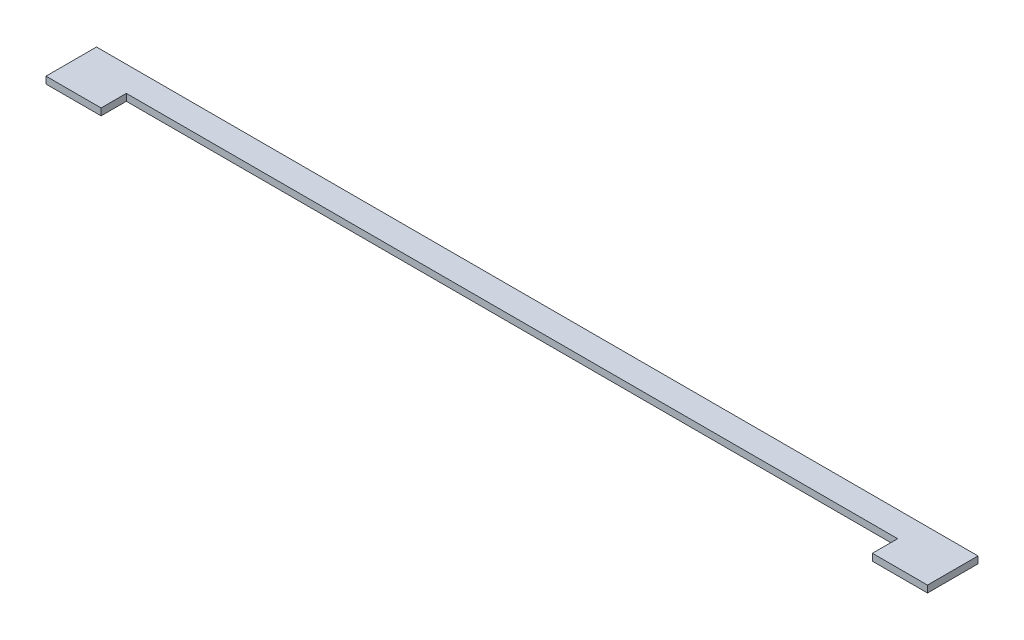
ISO-10303-21;
HEADER;
FILE_DESCRIPTION(('STEP AP214'),'2;1');
FILE_NAME('part.step','',(''),(''),'','','');
FILE_SCHEMA(('AUTOMOTIVE_DESIGN { 1 0 10303 214 1 1 1 1 }'));
ENDSEC;
DATA;
#1=APPLICATION_CONTEXT('core data for automotive mechanical design processes');
#2=APPLICATION_PROTOCOL_DEFINITION('international standard','automotive_design',2000,#1);
#3=PRODUCT_CONTEXT('',#1,'mechanical');
#4=PRODUCT('Part','Part','',(#3));
#5=PRODUCT_RELATED_PRODUCT_CATEGORY('part','',(#4));
#6=PRODUCT_DEFINITION_FORMATION('','',#4);
#7=PRODUCT_DEFINITION_CONTEXT('part definition',#1,'design');
#8=PRODUCT_DEFINITION('design','',#6,#7);
#9=PRODUCT_DEFINITION_SHAPE('','',#8);
#10=(LENGTH_UNIT() NAMED_UNIT(*) SI_UNIT(.MILLI.,.METRE.));
#11=(NAMED_UNIT(*) PLANE_ANGLE_UNIT() SI_UNIT($,.RADIAN.));
#12=(NAMED_UNIT(*) SI_UNIT($,.STERADIAN.) SOLID_ANGLE_UNIT());
#13=UNCERTAINTY_MEASURE_WITH_UNIT(LENGTH_MEASURE(1.E-05),#10,'distance_accuracy_value','');
#14=(GEOMETRIC_REPRESENTATION_CONTEXT(3) GLOBAL_UNCERTAINTY_ASSIGNED_CONTEXT((#13)) GLOBAL_UNIT_ASSIGNED_CONTEXT((#10,
#11,#12)) REPRESENTATION_CONTEXT('',''));
#15=CARTESIAN_POINT('',(0.,0.,0.));
#16=DIRECTION('',(0.,0.,1.));
#17=DIRECTION('',(1.,0.,0.));
#18=AXIS2_PLACEMENT_3D('',#15,#16,#17);
#19=CARTESIAN_POINT('',(-4183.01400519296,38.1,-128.418281868106));
#20=DIRECTION('',(1.,0.,0.));
#21=DIRECTION('',(0.,0.,-1.));
#22=AXIS2_PLACEMENT_3D('',#19,#20,#21);
#23=PLANE('',#22);
#24=DIRECTION('',(0.,0.,1.));
#25=VECTOR('',#24,1.);
#26=CARTESIAN_POINT('',(-4183.01400519296,0.,-128.418281868106));
#27=LINE('',#26,#25);
#28=CARTESIAN_POINT('',(-4183.01400519296,0.,-128.426397217144));
#29=VERTEX_POINT('',#28);
#30=CARTESIAN_POINT('',(-4183.01400519296,0.,11.2736027828564));
#31=VERTEX_POINT('',#30);
#32=EDGE_CURVE('E126',#29,#31,#27,.T.);
#33=ORIENTED_EDGE('',*,*,#32,.F.);
#34=DIRECTION('',(0.,-1.,0.));
#35=VECTOR('',#34,1.);
#36=CARTESIAN_POINT('',(-4183.01400519296,38.1,-128.426397217144));
#37=LINE('',#36,#35);
#38=CARTESIAN_POINT('',(-4183.01400519296,38.1,-128.426397217144));
#39=VERTEX_POINT('',#38);
#40=EDGE_CURVE('E11',#39,#29,#37,.T.);
#41=ORIENTED_EDGE('',*,*,#40,.F.);
#42=DIRECTION('',(0.,0.,1.));
#43=VECTOR('',#42,1.);
#44=CARTESIAN_POINT('',(-4183.01400519296,38.1,-128.418281868106));
#45=LINE('',#44,#43);
#46=CARTESIAN_POINT('',(-4183.01400519296,38.1,11.2736027828564));
#47=VERTEX_POINT('',#46);
#48=EDGE_CURVE('E144',#39,#47,#45,.T.);
#49=ORIENTED_EDGE('',*,*,#48,.T.);
#50=DIRECTION('',(0.,-1.,0.));
#51=VECTOR('',#50,1.);
#52=CARTESIAN_POINT('',(-4183.01400519296,38.1,11.2736027828564));
#53=LINE('',#52,#51);
#54=EDGE_CURVE('E81',#47,#31,#53,.T.);
#55=ORIENTED_EDGE('',*,*,#54,.T.);
#56=EDGE_LOOP('',(#33,#41,#49,#55));
#57=FACE_BOUND('',#56,.T.);
#58=ADVANCED_FACE('F31',(#57),#23,.T.);
#59=CARTESIAN_POINT('',(-5849.1100593099,38.1,-128.426397217144));
#60=DIRECTION('',(0.,0.,-1.));
#61=DIRECTION('',(-1.,0.,0.));
#62=AXIS2_PLACEMENT_3D('',#59,#60,#61);
#63=PLANE('',#62);
#64=DIRECTION('',(1.,0.,0.));
#65=VECTOR('',#64,1.);
#66=CARTESIAN_POINT('',(-5849.1100593099,0.,-128.426397217144));
#67=LINE('',#66,#65);
#68=CARTESIAN_POINT('',(84.1859948070392,0.,-128.426397217144));
#69=VERTEX_POINT('',#68);
#70=EDGE_CURVE('E129',#29,#69,#67,.T.);
#71=ORIENTED_EDGE('',*,*,#70,.T.);
#72=DIRECTION('',(0.,-1.,0.));
#73=VECTOR('',#72,1.);
#74=CARTESIAN_POINT('',(84.1859948070392,38.1,-128.426397217144));
#75=LINE('',#74,#73);
#76=CARTESIAN_POINT('',(84.1859948070392,38.1,-128.426397217144));
#77=VERTEX_POINT('',#76);
#78=EDGE_CURVE('E39',#77,#69,#75,.T.);
#79=ORIENTED_EDGE('',*,*,#78,.F.);
#80=DIRECTION('',(1.,0.,0.));
#81=VECTOR('',#80,1.);
#82=CARTESIAN_POINT('',(-5849.1100593099,38.1,-128.426397217144));
#83=LINE('',#82,#81);
#84=EDGE_CURVE('E168',#39,#77,#83,.T.);
#85=ORIENTED_EDGE('',*,*,#84,.F.);
#86=ORIENTED_EDGE('',*,*,#40,.T.);
#87=EDGE_LOOP('',(#71,#79,#85,#86));
#88=FACE_BOUND('',#87,.T.);
#89=ADVANCED_FACE('F172',(#88),#63,.F.);
#90=CARTESIAN_POINT('',(84.18599480704,38.1,-128.418281868122));
#91=DIRECTION('',(1.,0.,0.));
#92=DIRECTION('',(0.,0.,-1.));
#93=AXIS2_PLACEMENT_3D('',#90,#91,#92);
#94=PLANE('',#93);
#95=DIRECTION('',(0.,0.,1.));
#96=VECTOR('',#95,1.);
#97=CARTESIAN_POINT('',(84.18599480704,0.,-128.418281868122));
#98=LINE('',#97,#96);
#99=CARTESIAN_POINT('',(84.18599480704,0.,11.2736027828565));
#100=VERTEX_POINT('',#99);
#101=EDGE_CURVE('E131',#69,#100,#98,.T.);
#102=ORIENTED_EDGE('',*,*,#101,.T.);
#103=DIRECTION('',(0.,-1.,0.));
#104=VECTOR('',#103,1.);
#105=CARTESIAN_POINT('',(84.18599480704,38.1,11.2736027828565));
#106=LINE('',#105,#104);
#107=CARTESIAN_POINT('',(84.18599480704,38.1,11.2736027828565));
#108=VERTEX_POINT('',#107);
#109=EDGE_CURVE('E150',#108,#100,#106,.T.);
#110=ORIENTED_EDGE('',*,*,#109,.F.);
#111=DIRECTION('',(0.,0.,1.));
#112=VECTOR('',#111,1.);
#113=CARTESIAN_POINT('',(84.18599480704,38.1,-128.418281868122));
#114=LINE('',#113,#112);
#115=EDGE_CURVE('E158',#77,#108,#114,.T.);
#116=ORIENTED_EDGE('',*,*,#115,.F.);
#117=ORIENTED_EDGE('',*,*,#78,.T.);
#118=EDGE_LOOP('',(#102,#110,#116,#117));
#119=FACE_BOUND('',#118,.T.);
#120=ADVANCED_FACE('F156',(#119),#94,.F.);
#121=CARTESIAN_POINT('',(-5849.1100593099,38.1,11.2736027828576));
#122=DIRECTION('',(0.,0.,1.));
#123=DIRECTION('',(1.,0.,0.));
#124=AXIS2_PLACEMENT_3D('',#121,#122,#123);
#125=PLANE('',#124);
#126=DIRECTION('',(-1.,0.,0.));
#127=VECTOR('',#126,1.);
#128=CARTESIAN_POINT('',(-5849.1100593099,0.,11.2736027828576));
#129=LINE('',#128,#127);
#130=CARTESIAN_POINT('',(388.98599480704,0.,11.2736027828564));
#131=VERTEX_POINT('',#130);
#132=EDGE_CURVE('E134',#131,#100,#129,.T.);
#133=ORIENTED_EDGE('',*,*,#132,.F.);
#134=DIRECTION('',(0.,-1.,0.));
#135=VECTOR('',#134,1.);
#136=CARTESIAN_POINT('',(388.98599480704,38.1,11.2736027828564));
#137=LINE('',#136,#135);
#138=CARTESIAN_POINT('',(388.98599480704,38.1,11.2736027828564));
#139=VERTEX_POINT('',#138);
#140=EDGE_CURVE('E148',#139,#131,#137,.T.);
#141=ORIENTED_EDGE('',*,*,#140,.F.);
#142=DIRECTION('',(-1.,0.,0.));
#143=VECTOR('',#142,1.);
#144=CARTESIAN_POINT('',(-5849.1100593099,38.1,11.2736027828576));
#145=LINE('',#144,#143);
#146=EDGE_CURVE('E121',#139,#108,#145,.T.);
#147=ORIENTED_EDGE('',*,*,#146,.T.);
#148=ORIENTED_EDGE('',*,*,#109,.T.);
#149=EDGE_LOOP('',(#133,#141,#147,#148));
#150=FACE_BOUND('',#149,.T.);
#151=ADVANCED_FACE('F166',(#150),#125,.T.);
#152=CARTESIAN_POINT('',(388.98599480704,38.1,-128.418281868106));
#153=DIRECTION('',(1.,0.,0.));
#154=DIRECTION('',(0.,0.,-1.));
#155=AXIS2_PLACEMENT_3D('',#152,#153,#154);
#156=PLANE('',#155);
#157=DIRECTION('',(0.,0.,1.));
#158=VECTOR('',#157,1.);
#159=CARTESIAN_POINT('',(388.98599480704,0.,-128.418281868106));
#160=LINE('',#159,#158);
#161=CARTESIAN_POINT('',(388.98599480704,0.,-268.126397217144));
#162=VERTEX_POINT('',#161);
#163=EDGE_CURVE('E137',#162,#131,#160,.T.);
#164=ORIENTED_EDGE('',*,*,#163,.F.);
#165=DIRECTION('',(0.,-1.,0.));
#166=VECTOR('',#165,1.);
#167=CARTESIAN_POINT('',(388.98599480704,38.1,-268.126397217144));
#168=LINE('',#167,#166);
#169=CARTESIAN_POINT('',(388.98599480704,38.1,-268.126397217144));
#170=VERTEX_POINT('',#169);
#171=EDGE_CURVE('E109',#170,#162,#168,.T.);
#172=ORIENTED_EDGE('',*,*,#171,.F.);
#173=DIRECTION('',(0.,0.,1.));
#174=VECTOR('',#173,1.);
#175=CARTESIAN_POINT('',(388.98599480704,38.1,-128.418281868106));
#176=LINE('',#175,#174);
#177=EDGE_CURVE('E119',#170,#139,#176,.T.);
#178=ORIENTED_EDGE('',*,*,#177,.T.);
#179=ORIENTED_EDGE('',*,*,#140,.T.);
#180=EDGE_LOOP('',(#164,#172,#178,#179));
#181=FACE_BOUND('',#180,.T.);
#182=ADVANCED_FACE('F182',(#181),#156,.T.);
#183=CARTESIAN_POINT('',(-5849.1100593099,38.1,-268.126397217144));
#184=DIRECTION('',(0.,0.,-1.));
#185=DIRECTION('',(-1.,0.,0.));
#186=AXIS2_PLACEMENT_3D('',#183,#184,#185);
#187=PLANE('',#186);
#188=DIRECTION('',(1.,0.,0.));
#189=VECTOR('',#188,1.);
#190=CARTESIAN_POINT('',(-5849.1100593099,0.,-268.126397217144));
#191=LINE('',#190,#189);
#192=CARTESIAN_POINT('',(-4487.81400519296,0.,-268.126397217144));
#193=VERTEX_POINT('',#192);
#194=EDGE_CURVE('E108',#193,#162,#191,.T.);
#195=ORIENTED_EDGE('',*,*,#194,.F.);
#196=DIRECTION('',(0.,-1.,0.));
#197=VECTOR('',#196,1.);
#198=CARTESIAN_POINT('',(-4487.81400519296,38.1,-268.126397217144));
#199=LINE('',#198,#197);
#200=CARTESIAN_POINT('',(-4487.81400519296,38.1,-268.126397217144));
#201=VERTEX_POINT('',#200);
#202=EDGE_CURVE('E102',#201,#193,#199,.T.);
#203=ORIENTED_EDGE('',*,*,#202,.F.);
#204=DIRECTION('',(1.,0.,0.));
#205=VECTOR('',#204,1.);
#206=CARTESIAN_POINT('',(-5849.1100593099,38.1,-268.126397217144));
#207=LINE('',#206,#205);
#208=EDGE_CURVE('E106',#201,#170,#207,.T.);
#209=ORIENTED_EDGE('',*,*,#208,.T.);
#210=ORIENTED_EDGE('',*,*,#171,.T.);
#211=EDGE_LOOP('',(#195,#203,#209,#210));
#212=FACE_BOUND('',#211,.T.);
#213=ADVANCED_FACE('F104',(#212),#187,.T.);
#214=CARTESIAN_POINT('',(-4487.81400519296,38.1,-128.418281868106));
#215=DIRECTION('',(1.,0.,0.));
#216=DIRECTION('',(0.,0.,-1.));
#217=AXIS2_PLACEMENT_3D('',#214,#215,#216);
#218=PLANE('',#217);
#219=DIRECTION('',(0.,0.,1.));
#220=VECTOR('',#219,1.);
#221=CARTESIAN_POINT('',(-4487.81400519296,0.,-128.418281868106));
#222=LINE('',#221,#220);
#223=CARTESIAN_POINT('',(-4487.81400519296,0.,11.2736027828564));
#224=VERTEX_POINT('',#223);
#225=EDGE_CURVE('E74',#193,#224,#222,.T.);
#226=ORIENTED_EDGE('',*,*,#225,.T.);
#227=DIRECTION('',(0.,-1.,0.));
#228=VECTOR('',#227,1.);
#229=CARTESIAN_POINT('',(-4487.81400519296,38.1,11.2736027828564));
#230=LINE('',#229,#228);
#231=CARTESIAN_POINT('',(-4487.81400519296,38.1,11.2736027828564));
#232=VERTEX_POINT('',#231);
#233=EDGE_CURVE('E110',#232,#224,#230,.T.);
#234=ORIENTED_EDGE('',*,*,#233,.F.);
#235=DIRECTION('',(0.,0.,1.));
#236=VECTOR('',#235,1.);
#237=CARTESIAN_POINT('',(-4487.81400519296,38.1,-128.418281868106));
#238=LINE('',#237,#236);
#239=EDGE_CURVE('E112',#201,#232,#238,.T.);
#240=ORIENTED_EDGE('',*,*,#239,.F.);
#241=ORIENTED_EDGE('',*,*,#202,.T.);
#242=EDGE_LOOP('',(#226,#234,#240,#241));
#243=FACE_BOUND('',#242,.T.);
#244=ADVANCED_FACE('F113',(#243),#218,.F.);
#245=CARTESIAN_POINT('',(-5849.1100593099,38.1,11.2736027828564));
#246=DIRECTION('',(0.,0.,-1.));
#247=DIRECTION('',(-1.,0.,0.));
#248=AXIS2_PLACEMENT_3D('',#245,#246,#247);
#249=PLANE('',#248);
#250=DIRECTION('',(1.,0.,0.));
#251=VECTOR('',#250,1.);
#252=CARTESIAN_POINT('',(-5849.1100593099,0.,11.2736027828564));
#253=LINE('',#252,#251);
#254=EDGE_CURVE('E142',#224,#31,#253,.T.);
#255=ORIENTED_EDGE('',*,*,#254,.T.);
#256=ORIENTED_EDGE('',*,*,#54,.F.);
#257=DIRECTION('',(1.,0.,0.));
#258=VECTOR('',#257,1.);
#259=CARTESIAN_POINT('',(-5849.1100593099,38.1,11.2736027828564));
#260=LINE('',#259,#258);
#261=EDGE_CURVE('E47',#232,#47,#260,.T.);
#262=ORIENTED_EDGE('',*,*,#261,.F.);
#263=ORIENTED_EDGE('',*,*,#233,.T.);
#264=EDGE_LOOP('',(#255,#256,#262,#263));
#265=FACE_BOUND('',#264,.T.);
#266=ADVANCED_FACE('F190',(#265),#249,.F.);
#267=CARTESIAN_POINT('',(-5849.1100593099,38.1,-128.418281868106));
#268=DIRECTION('',(0.,1.,0.));
#269=DIRECTION('',(0.,0.,1.));
#270=AXIS2_PLACEMENT_3D('',#267,#268,#269);
#271=PLANE('',#270);
#272=ORIENTED_EDGE('',*,*,#48,.F.);
#273=ORIENTED_EDGE('',*,*,#84,.T.);
#274=ORIENTED_EDGE('',*,*,#115,.T.);
#275=ORIENTED_EDGE('',*,*,#146,.F.);
#276=ORIENTED_EDGE('',*,*,#177,.F.);
#277=ORIENTED_EDGE('',*,*,#208,.F.);
#278=ORIENTED_EDGE('',*,*,#239,.T.);
#279=ORIENTED_EDGE('',*,*,#261,.T.);
#280=EDGE_LOOP('',(#272,#273,#274,#275,#276,#277,#278,#279));
#281=FACE_BOUND('',#280,.T.);
#282=ADVANCED_FACE('F116',(#281),#271,.T.);
#283=CARTESIAN_POINT('',(-5849.1100593099,0.,-128.418281868106));
#284=DIRECTION('',(0.,1.,0.));
#285=DIRECTION('',(0.,0.,1.));
#286=AXIS2_PLACEMENT_3D('',#283,#284,#285);
#287=PLANE('',#286);
#288=ORIENTED_EDGE('',*,*,#32,.T.);
#289=ORIENTED_EDGE('',*,*,#254,.F.);
#290=ORIENTED_EDGE('',*,*,#225,.F.);
#291=ORIENTED_EDGE('',*,*,#194,.T.);
#292=ORIENTED_EDGE('',*,*,#163,.T.);
#293=ORIENTED_EDGE('',*,*,#132,.T.);
#294=ORIENTED_EDGE('',*,*,#101,.F.);
#295=ORIENTED_EDGE('',*,*,#70,.F.);
#296=EDGE_LOOP('',(#288,#289,#290,#291,#292,#293,#294,#295));
#297=FACE_BOUND('',#296,.T.);
#298=ADVANCED_FACE('F162',(#297),#287,.F.);
#299=CLOSED_SHELL('',(#58,#89,#120,#151,#182,#213,#244,#266,#282,#298));
#300=MANIFOLD_SOLID_BREP('B2',#299);
#301=ADVANCED_BREP_SHAPE_REPRESENTATION('',(#18,#300),#14);
#302=SHAPE_DEFINITION_REPRESENTATION(#9,#301);
ENDSEC;
END-ISO-10303-21;
